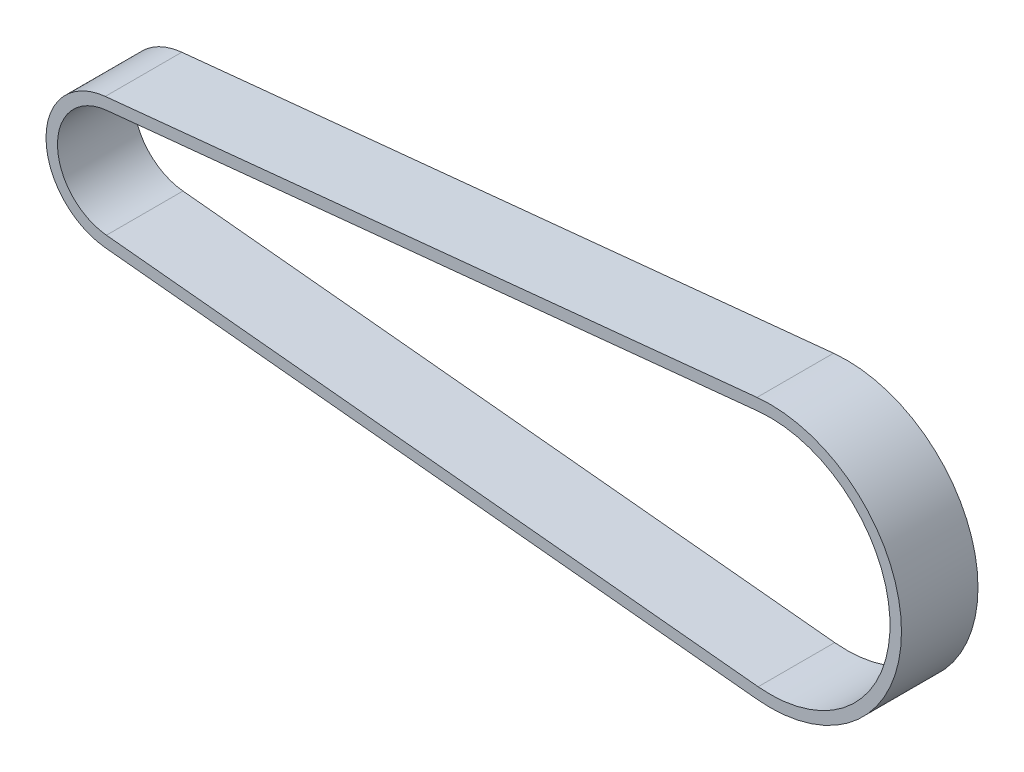
ISO-10303-21;
HEADER;
FILE_DESCRIPTION(('STEP AP214'),'2;1');
FILE_NAME('part.step','',(''),(''),'','','');
FILE_SCHEMA(('AUTOMOTIVE_DESIGN { 1 0 10303 214 1 1 1 1 }'));
ENDSEC;
DATA;
#1=APPLICATION_CONTEXT('core data for automotive mechanical design processes');
#2=APPLICATION_PROTOCOL_DEFINITION('international standard','automotive_design',2000,#1);
#3=PRODUCT_CONTEXT('',#1,'mechanical');
#4=PRODUCT('Part','Part','',(#3));
#5=PRODUCT_RELATED_PRODUCT_CATEGORY('part','',(#4));
#6=PRODUCT_DEFINITION_FORMATION('','',#4);
#7=PRODUCT_DEFINITION_CONTEXT('part definition',#1,'design');
#8=PRODUCT_DEFINITION('design','',#6,#7);
#9=PRODUCT_DEFINITION_SHAPE('','',#8);
#10=(LENGTH_UNIT() NAMED_UNIT(*) SI_UNIT(.MILLI.,.METRE.));
#11=(NAMED_UNIT(*) PLANE_ANGLE_UNIT() SI_UNIT($,.RADIAN.));
#12=(NAMED_UNIT(*) SI_UNIT($,.STERADIAN.) SOLID_ANGLE_UNIT());
#13=UNCERTAINTY_MEASURE_WITH_UNIT(LENGTH_MEASURE(1.E-05),#10,'distance_accuracy_value','');
#14=(GEOMETRIC_REPRESENTATION_CONTEXT(3) GLOBAL_UNCERTAINTY_ASSIGNED_CONTEXT((#13)) GLOBAL_UNIT_ASSIGNED_CONTEXT((#10,
#11,#12)) REPRESENTATION_CONTEXT('',''));
#15=CARTESIAN_POINT('',(0.,0.,0.));
#16=DIRECTION('',(0.,0.,1.));
#17=DIRECTION('',(1.,0.,0.));
#18=AXIS2_PLACEMENT_3D('',#15,#16,#17);
#19=CARTESIAN_POINT('',(-1.06113914454151,10.6070534888781,-6.));
#20=DIRECTION('',(0.0995440098068961,-0.995033160307517,0.));
#21=DIRECTION('',(0.995033160307517,0.0995440098068961,0.));
#22=AXIS2_PLACEMENT_3D('',#19,#20,#21);
#23=PLANE('',#22);
#24=DIRECTION('',(0.,0.,1.));
#25=VECTOR('',#24,1.);
#26=CARTESIAN_POINT('',(126.698620510043,23.3882544330278,-6.));
#27=LINE('',#26,#25);
#28=CARTESIAN_POINT('',(126.698620510043,23.3882544330278,-6.));
#29=VERTEX_POINT('',#28);
#30=CARTESIAN_POINT('',(126.698620510043,23.3882544330278,9.));
#31=VERTEX_POINT('',#30);
#32=EDGE_CURVE('E162',#29,#31,#27,.T.);
#33=ORIENTED_EDGE('',*,*,#32,.T.);
#34=DIRECTION('',(0.995033160307517,0.0995440098068961,0.));
#35=VECTOR('',#34,1.);
#36=CARTESIAN_POINT('',(-1.06113914454151,10.6070534888781,9.));
#37=LINE('',#36,#35);
#38=CARTESIAN_POINT('',(-1.06113914454152,10.6070534888781,9.));
#39=VERTEX_POINT('',#38);
#40=EDGE_CURVE('E132',#39,#31,#37,.T.);
#41=ORIENTED_EDGE('',*,*,#40,.F.);
#42=DIRECTION('',(0.,0.,1.));
#43=VECTOR('',#42,1.);
#44=CARTESIAN_POINT('',(-1.06113914454152,10.6070534888781,-6.));
#45=LINE('',#44,#43);
#46=CARTESIAN_POINT('',(-1.06113914454152,10.6070534888781,-6.));
#47=VERTEX_POINT('',#46);
#48=EDGE_CURVE('E11',#47,#39,#45,.T.);
#49=ORIENTED_EDGE('',*,*,#48,.F.);
#50=DIRECTION('',(0.995033160307517,0.0995440098068961,0.));
#51=VECTOR('',#50,1.);
#52=CARTESIAN_POINT('',(-1.06113914454151,10.6070534888781,-6.));
#53=LINE('',#52,#51);
#54=EDGE_CURVE('E151',#47,#29,#53,.T.);
#55=ORIENTED_EDGE('',*,*,#54,.T.);
#56=EDGE_LOOP('',(#33,#41,#49,#55));
#57=FACE_BOUND('',#56,.T.);
#58=ADVANCED_FACE('F37',(#57),#23,.T.);
#59=CARTESIAN_POINT('',(0.,0.,-6.));
#60=DIRECTION('',(0.,0.,1.));
#61=DIRECTION('',(1.,0.,0.));
#62=AXIS2_PLACEMENT_3D('',#59,#60,#61);
#63=CYLINDRICAL_SURFACE('',#62,10.66);
#64=ORIENTED_EDGE('',*,*,#48,.T.);
#65=CARTESIAN_POINT('',(0.,0.,9.));
#66=DIRECTION('',(0.,0.,1.));
#67=DIRECTION('',(1.,0.,0.));
#68=AXIS2_PLACEMENT_3D('',#65,#66,#67);
#69=CIRCLE('',#68,10.66);
#70=CARTESIAN_POINT('',(-1.06113914454158,-10.6070534888781,9.));
#71=VERTEX_POINT('',#70);
#72=EDGE_CURVE('E141',#71,#39,#69,.F.);
#73=ORIENTED_EDGE('',*,*,#72,.F.);
#74=DIRECTION('',(0.,0.,1.));
#75=VECTOR('',#74,1.);
#76=CARTESIAN_POINT('',(-1.06113914454158,-10.6070534888781,-6.));
#77=LINE('',#76,#75);
#78=CARTESIAN_POINT('',(-1.06113914454158,-10.6070534888781,-6.));
#79=VERTEX_POINT('',#78);
#80=EDGE_CURVE('E46',#79,#71,#77,.T.);
#81=ORIENTED_EDGE('',*,*,#80,.F.);
#82=CARTESIAN_POINT('',(0.,0.,-6.));
#83=DIRECTION('',(0.,0.,1.));
#84=DIRECTION('',(1.,0.,0.));
#85=AXIS2_PLACEMENT_3D('',#82,#83,#84);
#86=CIRCLE('',#85,10.66);
#87=EDGE_CURVE('E114',#79,#47,#86,.F.);
#88=ORIENTED_EDGE('',*,*,#87,.T.);
#89=EDGE_LOOP('',(#64,#73,#81,#88));
#90=FACE_BOUND('',#89,.T.);
#91=ADVANCED_FACE('F182',(#90),#63,.F.);
#92=CARTESIAN_POINT('',(-1.06113914454158,-10.6070534888781,-6.));
#93=DIRECTION('',(0.0995440098069021,0.995033160307516,0.));
#94=DIRECTION('',(-0.995033160307516,0.0995440098069021,0.));
#95=AXIS2_PLACEMENT_3D('',#92,#93,#94);
#96=PLANE('',#95);
#97=ORIENTED_EDGE('',*,*,#80,.T.);
#98=DIRECTION('',(-0.995033160307516,0.0995440098069021,0.));
#99=VECTOR('',#98,1.);
#100=CARTESIAN_POINT('',(-1.06113914454158,-10.6070534888781,9.));
#101=LINE('',#100,#99);
#102=CARTESIAN_POINT('',(126.698620510043,-23.3882544330286,9.));
#103=VERTEX_POINT('',#102);
#104=EDGE_CURVE('E138',#103,#71,#101,.T.);
#105=ORIENTED_EDGE('',*,*,#104,.F.);
#106=DIRECTION('',(0.,0.,1.));
#107=VECTOR('',#106,1.);
#108=CARTESIAN_POINT('',(126.698620510043,-23.3882544330286,-6.));
#109=LINE('',#108,#107);
#110=CARTESIAN_POINT('',(126.698620510043,-23.3882544330286,-6.));
#111=VERTEX_POINT('',#110);
#112=EDGE_CURVE('E160',#111,#103,#109,.T.);
#113=ORIENTED_EDGE('',*,*,#112,.F.);
#114=DIRECTION('',(-0.995033160307516,0.0995440098069021,0.));
#115=VECTOR('',#114,1.);
#116=CARTESIAN_POINT('',(-1.06113914454158,-10.6070534888781,-6.));
#117=LINE('',#116,#115);
#118=EDGE_CURVE('E156',#111,#79,#117,.T.);
#119=ORIENTED_EDGE('',*,*,#118,.T.);
#120=EDGE_LOOP('',(#97,#105,#113,#119));
#121=FACE_BOUND('',#120,.T.);
#122=ADVANCED_FACE('F187',(#121),#96,.T.);
#123=CARTESIAN_POINT('',(0.,0.,-6.));
#124=DIRECTION('',(0.,0.,1.));
#125=DIRECTION('',(1.,0.,0.));
#126=AXIS2_PLACEMENT_3D('',#123,#124,#125);
#127=CYLINDRICAL_SURFACE('',#126,12.91);
#128=DIRECTION('',(0.,0.,1.));
#129=VECTOR('',#128,1.);
#130=CARTESIAN_POINT('',(-1.28511316660712,-12.84587809957,-6.));
#131=LINE('',#130,#129);
#132=CARTESIAN_POINT('',(-1.28511316660712,-12.84587809957,-6.));
#133=VERTEX_POINT('',#132);
#134=CARTESIAN_POINT('',(-1.28511316660712,-12.84587809957,9.));
#135=VERTEX_POINT('',#134);
#136=EDGE_CURVE('E41',#133,#135,#131,.T.);
#137=ORIENTED_EDGE('',*,*,#136,.T.);
#138=CARTESIAN_POINT('',(0.,0.,9.));
#139=DIRECTION('',(0.,0.,1.));
#140=DIRECTION('',(1.,0.,0.));
#141=AXIS2_PLACEMENT_3D('',#138,#139,#140);
#142=CIRCLE('',#141,12.91);
#143=CARTESIAN_POINT('',(-1.28511316660704,12.84587809957,9.));
#144=VERTEX_POINT('',#143);
#145=EDGE_CURVE('E106',#135,#144,#142,.F.);
#146=ORIENTED_EDGE('',*,*,#145,.T.);
#147=DIRECTION('',(0.,0.,1.));
#148=VECTOR('',#147,1.);
#149=CARTESIAN_POINT('',(-1.28511316660704,12.84587809957,-6.));
#150=LINE('',#149,#148);
#151=CARTESIAN_POINT('',(-1.28511316660704,12.84587809957,-6.));
#152=VERTEX_POINT('',#151);
#153=EDGE_CURVE('E164',#152,#144,#150,.T.);
#154=ORIENTED_EDGE('',*,*,#153,.F.);
#155=CARTESIAN_POINT('',(0.,0.,-6.));
#156=DIRECTION('',(0.,0.,1.));
#157=DIRECTION('',(1.,0.,0.));
#158=AXIS2_PLACEMENT_3D('',#155,#156,#157);
#159=CIRCLE('',#158,12.91);
#160=EDGE_CURVE('E109',#133,#152,#159,.F.);
#161=ORIENTED_EDGE('',*,*,#160,.F.);
#162=EDGE_LOOP('',(#137,#146,#154,#161));
#163=FACE_BOUND('',#162,.T.);
#164=ADVANCED_FACE('F39',(#163),#127,.T.);
#165=CARTESIAN_POINT('',(-1.28511316660703,12.84587809957,-6.));
#166=DIRECTION('',(0.0995440098068961,-0.995033160307517,0.));
#167=DIRECTION('',(0.995033160307517,0.0995440098068961,0.));
#168=AXIS2_PLACEMENT_3D('',#165,#166,#167);
#169=PLANE('',#168);
#170=ORIENTED_EDGE('',*,*,#153,.T.);
#171=DIRECTION('',(0.995033160307517,0.0995440098068961,0.));
#172=VECTOR('',#171,1.);
#173=CARTESIAN_POINT('',(-1.28511316660703,12.84587809957,9.));
#174=LINE('',#173,#172);
#175=CARTESIAN_POINT('',(126.474646487978,25.6270790437197,9.));
#176=VERTEX_POINT('',#175);
#177=EDGE_CURVE('E123',#144,#176,#174,.T.);
#178=ORIENTED_EDGE('',*,*,#177,.T.);
#179=DIRECTION('',(0.,0.,1.));
#180=VECTOR('',#179,1.);
#181=CARTESIAN_POINT('',(126.474646487978,25.6270790437197,-6.));
#182=LINE('',#181,#180);
#183=CARTESIAN_POINT('',(126.474646487978,25.6270790437197,-6.));
#184=VERTEX_POINT('',#183);
#185=EDGE_CURVE('E166',#184,#176,#182,.T.);
#186=ORIENTED_EDGE('',*,*,#185,.F.);
#187=DIRECTION('',(0.995033160307517,0.0995440098068961,0.));
#188=VECTOR('',#187,1.);
#189=CARTESIAN_POINT('',(-1.28511316660703,12.84587809957,-6.));
#190=LINE('',#189,#188);
#191=EDGE_CURVE('E149',#152,#184,#190,.T.);
#192=ORIENTED_EDGE('',*,*,#191,.F.);
#193=EDGE_LOOP('',(#170,#178,#186,#192));
#194=FACE_BOUND('',#193,.T.);
#195=ADVANCED_FACE('F172',(#194),#169,.F.);
#196=CARTESIAN_POINT('',(129.038402460554,-3.88578058618805E-13,-6.));
#197=DIRECTION('',(0.,0.,1.));
#198=DIRECTION('',(1.,0.,0.));
#199=AXIS2_PLACEMENT_3D('',#196,#197,#198);
#200=CYLINDRICAL_SURFACE('',#199,25.755);
#201=ORIENTED_EDGE('',*,*,#185,.T.);
#202=CARTESIAN_POINT('',(129.038402460554,-3.88578058618805E-13,9.));
#203=DIRECTION('',(0.,0.,1.));
#204=DIRECTION('',(1.,0.,0.));
#205=AXIS2_PLACEMENT_3D('',#202,#203,#204);
#206=CIRCLE('',#205,25.755);
#207=CARTESIAN_POINT('',(126.474646487977,-25.6270790437205,9.));
#208=VERTEX_POINT('',#207);
#209=EDGE_CURVE('E127',#176,#208,#206,.F.);
#210=ORIENTED_EDGE('',*,*,#209,.T.);
#211=DIRECTION('',(0.,0.,1.));
#212=VECTOR('',#211,1.);
#213=CARTESIAN_POINT('',(126.474646487977,-25.6270790437205,-6.));
#214=LINE('',#213,#212);
#215=CARTESIAN_POINT('',(126.474646487977,-25.6270790437205,-6.));
#216=VERTEX_POINT('',#215);
#217=EDGE_CURVE('E113',#216,#208,#214,.T.);
#218=ORIENTED_EDGE('',*,*,#217,.F.);
#219=CARTESIAN_POINT('',(129.038402460554,-3.88578058618805E-13,-6.));
#220=DIRECTION('',(0.,0.,1.));
#221=DIRECTION('',(1.,0.,0.));
#222=AXIS2_PLACEMENT_3D('',#219,#220,#221);
#223=CIRCLE('',#222,25.755);
#224=EDGE_CURVE('E147',#184,#216,#223,.F.);
#225=ORIENTED_EDGE('',*,*,#224,.F.);
#226=EDGE_LOOP('',(#201,#210,#218,#225));
#227=FACE_BOUND('',#226,.T.);
#228=ADVANCED_FACE('F170',(#227),#200,.T.);
#229=CARTESIAN_POINT('',(-1.28511316660711,-12.84587809957,-6.));
#230=DIRECTION('',(0.0995440098069021,0.995033160307516,0.));
#231=DIRECTION('',(-0.995033160307516,0.0995440098069021,0.));
#232=AXIS2_PLACEMENT_3D('',#229,#230,#231);
#233=PLANE('',#232);
#234=ORIENTED_EDGE('',*,*,#217,.T.);
#235=DIRECTION('',(-0.995033160307516,0.0995440098069021,0.));
#236=VECTOR('',#235,1.);
#237=CARTESIAN_POINT('',(-1.28511316660711,-12.84587809957,9.));
#238=LINE('',#237,#236);
#239=EDGE_CURVE('E120',#208,#135,#238,.T.);
#240=ORIENTED_EDGE('',*,*,#239,.T.);
#241=ORIENTED_EDGE('',*,*,#136,.F.);
#242=DIRECTION('',(-0.995033160307516,0.0995440098069021,0.));
#243=VECTOR('',#242,1.);
#244=CARTESIAN_POINT('',(-1.28511316660711,-12.84587809957,-6.));
#245=LINE('',#244,#243);
#246=EDGE_CURVE('E145',#216,#133,#245,.T.);
#247=ORIENTED_EDGE('',*,*,#246,.F.);
#248=EDGE_LOOP('',(#234,#240,#241,#247));
#249=FACE_BOUND('',#248,.T.);
#250=ADVANCED_FACE('F125',(#249),#233,.F.);
#251=CARTESIAN_POINT('',(129.038402460554,-3.88578058618805E-13,-6.));
#252=DIRECTION('',(0.,0.,1.));
#253=DIRECTION('',(1.,0.,0.));
#254=AXIS2_PLACEMENT_3D('',#251,#252,#253);
#255=CYLINDRICAL_SURFACE('',#254,23.505);
#256=ORIENTED_EDGE('',*,*,#112,.T.);
#257=CARTESIAN_POINT('',(129.038402460554,-3.88578058618805E-13,9.));
#258=DIRECTION('',(0.,0.,1.));
#259=DIRECTION('',(1.,0.,0.));
#260=AXIS2_PLACEMENT_3D('',#257,#258,#259);
#261=CIRCLE('',#260,23.505);
#262=EDGE_CURVE('E135',#31,#103,#261,.F.);
#263=ORIENTED_EDGE('',*,*,#262,.F.);
#264=ORIENTED_EDGE('',*,*,#32,.F.);
#265=CARTESIAN_POINT('',(129.038402460554,-3.88578058618805E-13,-6.));
#266=DIRECTION('',(0.,0.,1.));
#267=DIRECTION('',(1.,0.,0.));
#268=AXIS2_PLACEMENT_3D('',#265,#266,#267);
#269=CIRCLE('',#268,23.505);
#270=EDGE_CURVE('E153',#29,#111,#269,.F.);
#271=ORIENTED_EDGE('',*,*,#270,.T.);
#272=EDGE_LOOP('',(#256,#263,#264,#271));
#273=FACE_BOUND('',#272,.T.);
#274=ADVANCED_FACE('F177',(#273),#255,.F.);
#275=CARTESIAN_POINT('',(0.,0.,-6.));
#276=DIRECTION('',(0.,0.,1.));
#277=DIRECTION('',(1.,0.,0.));
#278=AXIS2_PLACEMENT_3D('',#275,#276,#277);
#279=PLANE('',#278);
#280=ORIENTED_EDGE('',*,*,#160,.T.);
#281=ORIENTED_EDGE('',*,*,#191,.T.);
#282=ORIENTED_EDGE('',*,*,#224,.T.);
#283=ORIENTED_EDGE('',*,*,#246,.T.);
#284=EDGE_LOOP('',(#280,#281,#282,#283));
#285=FACE_BOUND('',#284,.T.);
#286=ORIENTED_EDGE('',*,*,#54,.F.);
#287=ORIENTED_EDGE('',*,*,#87,.F.);
#288=ORIENTED_EDGE('',*,*,#118,.F.);
#289=ORIENTED_EDGE('',*,*,#270,.F.);
#290=EDGE_LOOP('',(#286,#287,#288,#289));
#291=FACE_BOUND('',#290,.T.);
#292=ADVANCED_FACE('F174',(#285,#291),#279,.F.);
#293=CARTESIAN_POINT('',(0.,0.,9.));
#294=DIRECTION('',(0.,0.,1.));
#295=DIRECTION('',(1.,0.,0.));
#296=AXIS2_PLACEMENT_3D('',#293,#294,#295);
#297=PLANE('',#296);
#298=ORIENTED_EDGE('',*,*,#145,.F.);
#299=ORIENTED_EDGE('',*,*,#239,.F.);
#300=ORIENTED_EDGE('',*,*,#209,.F.);
#301=ORIENTED_EDGE('',*,*,#177,.F.);
#302=EDGE_LOOP('',(#298,#299,#300,#301));
#303=FACE_BOUND('',#302,.T.);
#304=ORIENTED_EDGE('',*,*,#40,.T.);
#305=ORIENTED_EDGE('',*,*,#262,.T.);
#306=ORIENTED_EDGE('',*,*,#104,.T.);
#307=ORIENTED_EDGE('',*,*,#72,.T.);
#308=EDGE_LOOP('',(#304,#305,#306,#307));
#309=FACE_BOUND('',#308,.T.);
#310=ADVANCED_FACE('F117',(#303,#309),#297,.T.);
#311=CLOSED_SHELL('',(#58,#91,#122,#164,#195,#228,#250,#274,#292,#310));
#312=MANIFOLD_SOLID_BREP('B2',#311);
#313=ADVANCED_BREP_SHAPE_REPRESENTATION('',(#18,#312),#14);
#314=SHAPE_DEFINITION_REPRESENTATION(#9,#313);
ENDSEC;
END-ISO-10303-21;
